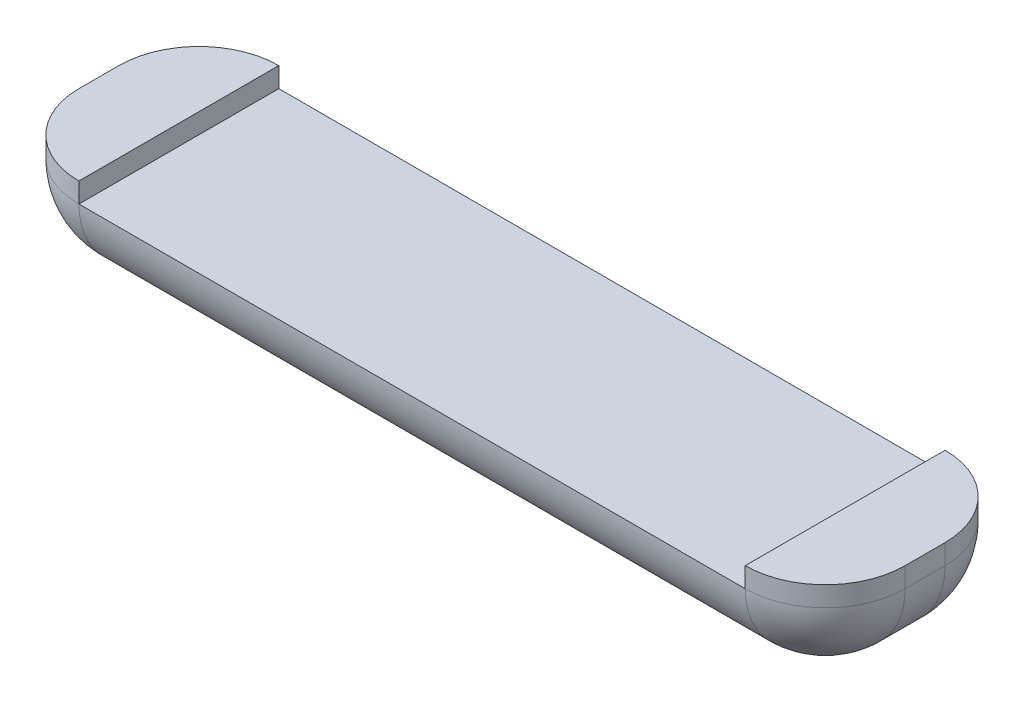
ISO-10303-21;
HEADER;
FILE_DESCRIPTION(('STEP AP214'),'2;1');
FILE_NAME('part.step','',(''),(''),'','','');
FILE_SCHEMA(('AUTOMOTIVE_DESIGN { 1 0 10303 214 1 1 1 1 }'));
ENDSEC;
DATA;
#1=APPLICATION_CONTEXT('core data for automotive mechanical design processes');
#2=APPLICATION_PROTOCOL_DEFINITION('international standard','automotive_design',2000,#1);
#3=PRODUCT_CONTEXT('',#1,'mechanical');
#4=PRODUCT('Part','Part','',(#3));
#5=PRODUCT_RELATED_PRODUCT_CATEGORY('part','',(#4));
#6=PRODUCT_DEFINITION_FORMATION('','',#4);
#7=PRODUCT_DEFINITION_CONTEXT('part definition',#1,'design');
#8=PRODUCT_DEFINITION('design','',#6,#7);
#9=PRODUCT_DEFINITION_SHAPE('','',#8);
#10=(LENGTH_UNIT() NAMED_UNIT(*) SI_UNIT(.MILLI.,.METRE.));
#11=(NAMED_UNIT(*) PLANE_ANGLE_UNIT() SI_UNIT($,.RADIAN.));
#12=(NAMED_UNIT(*) SI_UNIT($,.STERADIAN.) SOLID_ANGLE_UNIT());
#13=UNCERTAINTY_MEASURE_WITH_UNIT(LENGTH_MEASURE(1.E-05),#10,'distance_accuracy_value','');
#14=(GEOMETRIC_REPRESENTATION_CONTEXT(3) GLOBAL_UNCERTAINTY_ASSIGNED_CONTEXT((#13)) GLOBAL_UNIT_ASSIGNED_CONTEXT((#10,
#11,#12)) REPRESENTATION_CONTEXT('',''));
#15=CARTESIAN_POINT('',(0.,0.,0.));
#16=DIRECTION('',(0.,0.,1.));
#17=DIRECTION('',(1.,0.,0.));
#18=AXIS2_PLACEMENT_3D('',#15,#16,#17);
#19=CARTESIAN_POINT('',(62.,-1.5,-1.5));
#20=DIRECTION('',(-1.,0.,0.));
#21=DIRECTION('',(0.,0.,1.));
#22=AXIS2_PLACEMENT_3D('',#19,#20,#21);
#23=CYLINDRICAL_SURFACE('',#22,6.);
#24=DIRECTION('',(-1.,0.,0.));
#25=VECTOR('',#24,1.);
#26=CARTESIAN_POINT('',(62.,-1.49999999999996,-7.5));
#27=LINE('',#26,#25);
#28=CARTESIAN_POINT('',(56.,-1.50000000000004,-7.5));
#29=VERTEX_POINT('',#28);
#30=CARTESIAN_POINT('',(5.99999999999999,-1.50000000000004,-7.5));
#31=VERTEX_POINT('',#30);
#32=EDGE_CURVE('E129',#29,#31,#27,.T.);
#33=ORIENTED_EDGE('',*,*,#32,.F.);
#34=CARTESIAN_POINT('',(56.,-1.5,-1.5));
#35=DIRECTION('',(-1.,0.,0.));
#36=DIRECTION('',(0.,0.,1.));
#37=AXIS2_PLACEMENT_3D('',#34,#35,#36);
#38=CIRCLE('',#37,6.);
#39=CARTESIAN_POINT('',(56.,-7.5,-1.49999999999996));
#40=VERTEX_POINT('',#39);
#41=EDGE_CURVE('E43',#29,#40,#38,.T.);
#42=ORIENTED_EDGE('',*,*,#41,.T.);
#43=DIRECTION('',(-1.,0.,0.));
#44=VECTOR('',#43,1.);
#45=CARTESIAN_POINT('',(62.,-7.5,-1.49999999999996));
#46=LINE('',#45,#44);
#47=CARTESIAN_POINT('',(6.,-7.5,-1.49999999999996));
#48=VERTEX_POINT('',#47);
#49=EDGE_CURVE('E163',#40,#48,#46,.T.);
#50=ORIENTED_EDGE('',*,*,#49,.T.);
#51=CARTESIAN_POINT('',(6.,-1.5,-1.5));
#52=DIRECTION('',(-1.,0.,0.));
#53=DIRECTION('',(0.,0.,1.));
#54=AXIS2_PLACEMENT_3D('',#51,#52,#53);
#55=CIRCLE('',#54,6.);
#56=EDGE_CURVE('E148',#48,#31,#55,.F.);
#57=ORIENTED_EDGE('',*,*,#56,.T.);
#58=EDGE_LOOP('',(#33,#42,#50,#57));
#59=FACE_BOUND('',#58,.T.);
#60=ADVANCED_FACE('F35',(#59),#23,.T.);
#61=CARTESIAN_POINT('',(62.,-1.5,1.5));
#62=DIRECTION('',(-1.,0.,0.));
#63=DIRECTION('',(0.,0.,1.));
#64=AXIS2_PLACEMENT_3D('',#61,#62,#63);
#65=CYLINDRICAL_SURFACE('',#64,6.);
#66=DIRECTION('',(-1.,0.,0.));
#67=VECTOR('',#66,1.);
#68=CARTESIAN_POINT('',(62.,-7.5,1.49999999999996));
#69=LINE('',#68,#67);
#70=CARTESIAN_POINT('',(56.,-7.5,1.49999999999996));
#71=VERTEX_POINT('',#70);
#72=CARTESIAN_POINT('',(6.,-7.5,1.49999999999996));
#73=VERTEX_POINT('',#72);
#74=EDGE_CURVE('E217',#71,#73,#69,.T.);
#75=ORIENTED_EDGE('',*,*,#74,.F.);
#76=CARTESIAN_POINT('',(56.,-1.5,1.5));
#77=DIRECTION('',(-1.,0.,0.));
#78=DIRECTION('',(0.,0.,1.));
#79=AXIS2_PLACEMENT_3D('',#76,#77,#78);
#80=CIRCLE('',#79,6.);
#81=CARTESIAN_POINT('',(56.,-1.49999999999996,7.5));
#82=VERTEX_POINT('',#81);
#83=EDGE_CURVE('E174',#71,#82,#80,.T.);
#84=ORIENTED_EDGE('',*,*,#83,.T.);
#85=DIRECTION('',(-1.,0.,0.));
#86=VECTOR('',#85,1.);
#87=CARTESIAN_POINT('',(62.,-1.49999999999996,7.5));
#88=LINE('',#87,#86);
#89=CARTESIAN_POINT('',(5.99999999999998,-1.50000000000004,7.49999999999994));
#90=VERTEX_POINT('',#89);
#91=EDGE_CURVE('E133',#82,#90,#88,.T.);
#92=ORIENTED_EDGE('',*,*,#91,.T.);
#93=CARTESIAN_POINT('',(6.,-1.5,1.5));
#94=DIRECTION('',(-1.,0.,0.));
#95=DIRECTION('',(0.,0.,1.));
#96=AXIS2_PLACEMENT_3D('',#93,#94,#95);
#97=CIRCLE('',#96,6.);
#98=EDGE_CURVE('E142',#90,#73,#97,.F.);
#99=ORIENTED_EDGE('',*,*,#98,.T.);
#100=EDGE_LOOP('',(#75,#84,#92,#99));
#101=FACE_BOUND('',#100,.T.);
#102=ADVANCED_FACE('F215',(#101),#65,.T.);
#103=CARTESIAN_POINT('',(62.,-7.5,1.49999999999996));
#104=DIRECTION('',(0.,1.,0.));
#105=DIRECTION('',(0.,0.,1.));
#106=AXIS2_PLACEMENT_3D('',#103,#104,#105);
#107=PLANE('',#106);
#108=ORIENTED_EDGE('',*,*,#49,.F.);
#109=DIRECTION('',(0.,0.,-1.));
#110=VECTOR('',#109,1.);
#111=CARTESIAN_POINT('',(56.,-7.5,1.49999999999996));
#112=LINE('',#111,#110);
#113=EDGE_CURVE('E171',#40,#71,#112,.F.);
#114=ORIENTED_EDGE('',*,*,#113,.T.);
#115=ORIENTED_EDGE('',*,*,#74,.T.);
#116=DIRECTION('',(0.,0.,-1.));
#117=VECTOR('',#116,1.);
#118=CARTESIAN_POINT('',(6.,-7.5,-1.49999999999996));
#119=LINE('',#118,#117);
#120=EDGE_CURVE('E145',#73,#48,#119,.T.);
#121=ORIENTED_EDGE('',*,*,#120,.T.);
#122=EDGE_LOOP('',(#108,#114,#115,#121));
#123=FACE_BOUND('',#122,.T.);
#124=ADVANCED_FACE('F261',(#123),#107,.F.);
#125=CARTESIAN_POINT('',(62.,-1.5,-1.5));
#126=DIRECTION('',(-1.,0.,0.));
#127=DIRECTION('',(0.,0.,1.));
#128=AXIS2_PLACEMENT_3D('',#125,#126,#127);
#129=PLANE('',#128);
#130=DIRECTION('',(0.,1.,0.));
#131=VECTOR('',#130,1.);
#132=CARTESIAN_POINT('',(62.,-1.5,-1.5));
#133=LINE('',#132,#131);
#134=CARTESIAN_POINT('',(62.,-1.49999999999996,-1.5));
#135=VERTEX_POINT('',#134);
#136=CARTESIAN_POINT('',(62.,0.,-1.5));
#137=VERTEX_POINT('',#136);
#138=EDGE_CURVE('E150',#135,#137,#133,.T.);
#139=ORIENTED_EDGE('',*,*,#138,.T.);
#140=DIRECTION('',(0.,0.,1.));
#141=VECTOR('',#140,1.);
#142=CARTESIAN_POINT('',(62.,0.,-1.5));
#143=LINE('',#142,#141);
#144=CARTESIAN_POINT('',(62.,0.,1.5));
#145=VERTEX_POINT('',#144);
#146=EDGE_CURVE('E210',#137,#145,#143,.T.);
#147=ORIENTED_EDGE('',*,*,#146,.T.);
#148=DIRECTION('',(0.,-1.,0.));
#149=VECTOR('',#148,1.);
#150=CARTESIAN_POINT('',(62.,-1.5,1.5));
#151=LINE('',#150,#149);
#152=CARTESIAN_POINT('',(62.,-1.5,1.5));
#153=VERTEX_POINT('',#152);
#154=EDGE_CURVE('E166',#145,#153,#151,.T.);
#155=ORIENTED_EDGE('',*,*,#154,.T.);
#156=DIRECTION('',(0.,0.,-1.));
#157=VECTOR('',#156,1.);
#158=CARTESIAN_POINT('',(62.,-1.5,-1.5));
#159=LINE('',#158,#157);
#160=EDGE_CURVE('E168',#153,#135,#159,.T.);
#161=ORIENTED_EDGE('',*,*,#160,.T.);
#162=EDGE_LOOP('',(#139,#147,#155,#161));
#163=FACE_BOUND('',#162,.T.);
#164=ADVANCED_FACE('F278',(#163),#129,.F.);
#165=CARTESIAN_POINT('',(0.,-1.5,-1.5));
#166=DIRECTION('',(-1.,0.,0.));
#167=DIRECTION('',(0.,0.,1.));
#168=AXIS2_PLACEMENT_3D('',#165,#166,#167);
#169=PLANE('',#168);
#170=DIRECTION('',(0.,0.,1.));
#171=VECTOR('',#170,1.);
#172=CARTESIAN_POINT('',(0.,0.,-1.5));
#173=LINE('',#172,#171);
#174=CARTESIAN_POINT('',(0.,0.,-1.49999999999998));
#175=VERTEX_POINT('',#174);
#176=CARTESIAN_POINT('',(0.,0.,1.5));
#177=VERTEX_POINT('',#176);
#178=EDGE_CURVE('E230',#175,#177,#173,.T.);
#179=ORIENTED_EDGE('',*,*,#178,.F.);
#180=DIRECTION('',(0.,1.,0.));
#181=VECTOR('',#180,1.);
#182=CARTESIAN_POINT('',(0.,-1.49999999999996,-1.5));
#183=LINE('',#182,#181);
#184=CARTESIAN_POINT('',(0.,-1.5,-1.49999999999996));
#185=VERTEX_POINT('',#184);
#186=EDGE_CURVE('E121',#175,#185,#183,.F.);
#187=ORIENTED_EDGE('',*,*,#186,.T.);
#188=DIRECTION('',(0.,0.,-1.));
#189=VECTOR('',#188,1.);
#190=CARTESIAN_POINT('',(0.,-1.5,1.49999999999996));
#191=LINE('',#190,#189);
#192=CARTESIAN_POINT('',(0.,-1.5,1.5));
#193=VERTEX_POINT('',#192);
#194=EDGE_CURVE('E128',#185,#193,#191,.F.);
#195=ORIENTED_EDGE('',*,*,#194,.T.);
#196=DIRECTION('',(0.,-1.,0.));
#197=VECTOR('',#196,1.);
#198=CARTESIAN_POINT('',(0.,1.49999999999996,1.5));
#199=LINE('',#198,#197);
#200=EDGE_CURVE('E131',#193,#177,#199,.F.);
#201=ORIENTED_EDGE('',*,*,#200,.T.);
#202=EDGE_LOOP('',(#179,#187,#195,#201));
#203=FACE_BOUND('',#202,.T.);
#204=ADVANCED_FACE('F236',(#203),#169,.T.);
#205=CARTESIAN_POINT('',(6.,-1.49999999999996,1.5));
#206=DIRECTION('',(0.,1.,0.));
#207=DIRECTION('',(0.,0.,1.));
#208=AXIS2_PLACEMENT_3D('',#205,#206,#207);
#209=CYLINDRICAL_SURFACE('',#208,6.);
#210=CARTESIAN_POINT('',(6.,0.,1.5));
#211=DIRECTION('',(0.,-1.,0.));
#212=DIRECTION('',(0.,0.,-1.));
#213=AXIS2_PLACEMENT_3D('',#210,#211,#212);
#214=CIRCLE('',#213,6.);
#215=CARTESIAN_POINT('',(6.,0.,7.5));
#216=VERTEX_POINT('',#215);
#217=EDGE_CURVE('E57',#177,#216,#214,.F.);
#218=ORIENTED_EDGE('',*,*,#217,.F.);
#219=ORIENTED_EDGE('',*,*,#200,.F.);
#220=CARTESIAN_POINT('',(6.,-1.49999999999996,1.5));
#221=DIRECTION('',(0.,-1.,0.));
#222=DIRECTION('',(0.,0.,-1.));
#223=AXIS2_PLACEMENT_3D('',#220,#221,#222);
#224=CIRCLE('',#223,6.);
#225=EDGE_CURVE('E160',#90,#193,#224,.T.);
#226=ORIENTED_EDGE('',*,*,#225,.F.);
#227=DIRECTION('',(0.,-1.,0.));
#228=VECTOR('',#227,1.);
#229=CARTESIAN_POINT('',(6.,-1.49999999999996,7.5));
#230=LINE('',#229,#228);
#231=EDGE_CURVE('E140',#216,#90,#230,.T.);
#232=ORIENTED_EDGE('',*,*,#231,.F.);
#233=EDGE_LOOP('',(#218,#219,#226,#232));
#234=FACE_BOUND('',#233,.T.);
#235=ADVANCED_FACE('F235',(#234),#209,.T.);
#236=CARTESIAN_POINT('',(6.,-1.5,1.5));
#237=DIRECTION('',(-1.,0.,0.));
#238=DIRECTION('',(0.,0.,1.));
#239=AXIS2_PLACEMENT_3D('',#236,#237,#238);
#240=SPHERICAL_SURFACE('',#239,6.);
#241=ORIENTED_EDGE('',*,*,#98,.F.);
#242=ORIENTED_EDGE('',*,*,#225,.T.);
#243=CARTESIAN_POINT('',(6.,-1.5,1.5));
#244=DIRECTION('',(0.,0.,-1.));
#245=DIRECTION('',(0.,1.,0.));
#246=AXIS2_PLACEMENT_3D('',#243,#244,#245);
#247=CIRCLE('',#246,6.);
#248=EDGE_CURVE('E157',#73,#193,#247,.T.);
#249=ORIENTED_EDGE('',*,*,#248,.F.);
#250=EDGE_LOOP('',(#241,#242,#249));
#251=FACE_BOUND('',#250,.T.);
#252=ADVANCED_FACE('F244',(#251),#240,.T.);
#253=CARTESIAN_POINT('',(6.,-1.5,1.49999999999996));
#254=DIRECTION('',(0.,0.,1.));
#255=DIRECTION('',(1.,0.,0.));
#256=AXIS2_PLACEMENT_3D('',#253,#254,#255);
#257=CYLINDRICAL_SURFACE('',#256,6.);
#258=ORIENTED_EDGE('',*,*,#248,.T.);
#259=ORIENTED_EDGE('',*,*,#194,.F.);
#260=CARTESIAN_POINT('',(6.,-1.5,-1.49999999999996));
#261=DIRECTION('',(0.,0.,-1.));
#262=DIRECTION('',(-1.,0.,0.));
#263=AXIS2_PLACEMENT_3D('',#260,#261,#262);
#264=CIRCLE('',#263,6.);
#265=EDGE_CURVE('E153',#48,#185,#264,.T.);
#266=ORIENTED_EDGE('',*,*,#265,.F.);
#267=ORIENTED_EDGE('',*,*,#120,.F.);
#268=EDGE_LOOP('',(#258,#259,#266,#267));
#269=FACE_BOUND('',#268,.T.);
#270=ADVANCED_FACE('F240',(#269),#257,.T.);
#271=CARTESIAN_POINT('',(6.,-1.5,-1.5));
#272=DIRECTION('',(-1.,0.,0.));
#273=DIRECTION('',(0.,0.,1.));
#274=AXIS2_PLACEMENT_3D('',#271,#272,#273);
#275=SPHERICAL_SURFACE('',#274,6.);
#276=ORIENTED_EDGE('',*,*,#56,.F.);
#277=ORIENTED_EDGE('',*,*,#265,.T.);
#278=CARTESIAN_POINT('',(6.,-1.5,-1.5));
#279=DIRECTION('',(0.,1.,0.));
#280=DIRECTION('',(0.,0.,1.));
#281=AXIS2_PLACEMENT_3D('',#278,#279,#280);
#282=CIRCLE('',#281,6.);
#283=EDGE_CURVE('E151',#31,#185,#282,.T.);
#284=ORIENTED_EDGE('',*,*,#283,.F.);
#285=EDGE_LOOP('',(#276,#277,#284));
#286=FACE_BOUND('',#285,.T.);
#287=ADVANCED_FACE('F251',(#286),#275,.T.);
#288=CARTESIAN_POINT('',(6.,-1.49999999999996,-1.5));
#289=DIRECTION('',(0.,-1.,0.));
#290=DIRECTION('',(0.,0.,-1.));
#291=AXIS2_PLACEMENT_3D('',#288,#289,#290);
#292=CYLINDRICAL_SURFACE('',#291,6.);
#293=CARTESIAN_POINT('',(6.,0.,-1.5));
#294=DIRECTION('',(0.,-1.,0.));
#295=DIRECTION('',(0.,0.,-1.));
#296=AXIS2_PLACEMENT_3D('',#293,#294,#295);
#297=CIRCLE('',#296,6.);
#298=CARTESIAN_POINT('',(5.99999999999999,0.,-7.5));
#299=VERTEX_POINT('',#298);
#300=EDGE_CURVE('E110',#299,#175,#297,.F.);
#301=ORIENTED_EDGE('',*,*,#300,.F.);
#302=DIRECTION('',(0.,1.,0.));
#303=VECTOR('',#302,1.);
#304=CARTESIAN_POINT('',(6.,1.49999999999996,-7.5));
#305=LINE('',#304,#303);
#306=EDGE_CURVE('E120',#31,#299,#305,.T.);
#307=ORIENTED_EDGE('',*,*,#306,.F.);
#308=ORIENTED_EDGE('',*,*,#283,.T.);
#309=ORIENTED_EDGE('',*,*,#186,.F.);
#310=EDGE_LOOP('',(#301,#307,#308,#309));
#311=FACE_BOUND('',#310,.T.);
#312=ADVANCED_FACE('F118',(#311),#292,.T.);
#313=CARTESIAN_POINT('',(56.,-1.5,1.5));
#314=DIRECTION('',(0.,-1.,0.));
#315=DIRECTION('',(0.,0.,-1.));
#316=AXIS2_PLACEMENT_3D('',#313,#314,#315);
#317=CYLINDRICAL_SURFACE('',#316,6.);
#318=CARTESIAN_POINT('',(56.,0.,1.5));
#319=DIRECTION('',(0.,-1.,0.));
#320=DIRECTION('',(0.,0.,-1.));
#321=AXIS2_PLACEMENT_3D('',#318,#319,#320);
#322=CIRCLE('',#321,6.);
#323=CARTESIAN_POINT('',(56.,0.,7.5));
#324=VERTEX_POINT('',#323);
#325=EDGE_CURVE('E200',#324,#145,#322,.F.);
#326=ORIENTED_EDGE('',*,*,#325,.F.);
#327=DIRECTION('',(0.,-1.,0.));
#328=VECTOR('',#327,1.);
#329=CARTESIAN_POINT('',(56.,-1.49999999999996,7.5));
#330=LINE('',#329,#328);
#331=EDGE_CURVE('E177',#82,#324,#330,.F.);
#332=ORIENTED_EDGE('',*,*,#331,.F.);
#333=CARTESIAN_POINT('',(56.,-1.5,1.5));
#334=DIRECTION('',(0.,-1.,0.));
#335=DIRECTION('',(0.,0.,-1.));
#336=AXIS2_PLACEMENT_3D('',#333,#334,#335);
#337=CIRCLE('',#336,6.);
#338=EDGE_CURVE('E154',#153,#82,#337,.T.);
#339=ORIENTED_EDGE('',*,*,#338,.F.);
#340=ORIENTED_EDGE('',*,*,#154,.F.);
#341=EDGE_LOOP('',(#326,#332,#339,#340));
#342=FACE_BOUND('',#341,.T.);
#343=ADVANCED_FACE('F37',(#342),#317,.T.);
#344=CARTESIAN_POINT('',(56.,-1.5,-1.5));
#345=DIRECTION('',(0.,1.,0.));
#346=DIRECTION('',(0.,0.,1.));
#347=AXIS2_PLACEMENT_3D('',#344,#345,#346);
#348=CYLINDRICAL_SURFACE('',#347,6.);
#349=CARTESIAN_POINT('',(56.,0.,-1.5));
#350=DIRECTION('',(0.,-1.,0.));
#351=DIRECTION('',(0.,0.,-1.));
#352=AXIS2_PLACEMENT_3D('',#349,#350,#351);
#353=CIRCLE('',#352,6.);
#354=CARTESIAN_POINT('',(56.,0.,-7.5));
#355=VERTEX_POINT('',#354);
#356=EDGE_CURVE('E50',#137,#355,#353,.F.);
#357=ORIENTED_EDGE('',*,*,#356,.F.);
#358=ORIENTED_EDGE('',*,*,#138,.F.);
#359=CARTESIAN_POINT('',(56.,-1.49999999999996,-1.5));
#360=DIRECTION('',(0.,-1.,0.));
#361=DIRECTION('',(0.,0.,-1.));
#362=AXIS2_PLACEMENT_3D('',#359,#360,#361);
#363=CIRCLE('',#362,6.);
#364=EDGE_CURVE('E187',#29,#135,#363,.T.);
#365=ORIENTED_EDGE('',*,*,#364,.F.);
#366=DIRECTION('',(0.,1.,0.));
#367=VECTOR('',#366,1.);
#368=CARTESIAN_POINT('',(56.,-1.49999999999996,-7.5));
#369=LINE('',#368,#367);
#370=EDGE_CURVE('E180',#355,#29,#369,.F.);
#371=ORIENTED_EDGE('',*,*,#370,.F.);
#372=EDGE_LOOP('',(#357,#358,#365,#371));
#373=FACE_BOUND('',#372,.T.);
#374=ADVANCED_FACE('F320',(#373),#348,.T.);
#375=CARTESIAN_POINT('',(56.,-1.5,1.5));
#376=DIRECTION('',(-1.,0.,0.));
#377=DIRECTION('',(0.,0.,1.));
#378=AXIS2_PLACEMENT_3D('',#375,#376,#377);
#379=SPHERICAL_SURFACE('',#378,6.);
#380=ORIENTED_EDGE('',*,*,#338,.T.);
#381=ORIENTED_EDGE('',*,*,#83,.F.);
#382=CARTESIAN_POINT('',(56.,-1.5,1.5));
#383=DIRECTION('',(0.,0.,-1.));
#384=DIRECTION('',(0.,1.,0.));
#385=AXIS2_PLACEMENT_3D('',#382,#383,#384);
#386=CIRCLE('',#385,6.);
#387=EDGE_CURVE('E185',#153,#71,#386,.T.);
#388=ORIENTED_EDGE('',*,*,#387,.F.);
#389=EDGE_LOOP('',(#380,#381,#388));
#390=FACE_BOUND('',#389,.T.);
#391=ADVANCED_FACE('F194',(#390),#379,.T.);
#392=CARTESIAN_POINT('',(56.,-1.5,-1.5));
#393=DIRECTION('',(-1.,0.,0.));
#394=DIRECTION('',(0.,0.,1.));
#395=AXIS2_PLACEMENT_3D('',#392,#393,#394);
#396=SPHERICAL_SURFACE('',#395,6.);
#397=ORIENTED_EDGE('',*,*,#41,.F.);
#398=ORIENTED_EDGE('',*,*,#364,.T.);
#399=CARTESIAN_POINT('',(56.,-1.5,-1.5));
#400=DIRECTION('',(0.,0.,1.));
#401=DIRECTION('',(0.,-1.,0.));
#402=AXIS2_PLACEMENT_3D('',#399,#400,#401);
#403=CIRCLE('',#402,6.);
#404=EDGE_CURVE('E183',#40,#135,#403,.T.);
#405=ORIENTED_EDGE('',*,*,#404,.F.);
#406=EDGE_LOOP('',(#397,#398,#405));
#407=FACE_BOUND('',#406,.T.);
#408=ADVANCED_FACE('F354',(#407),#396,.T.);
#409=CARTESIAN_POINT('',(56.,-1.5,-1.5));
#410=DIRECTION('',(0.,0.,-1.));
#411=DIRECTION('',(-1.,0.,0.));
#412=AXIS2_PLACEMENT_3D('',#409,#410,#411);
#413=CYLINDRICAL_SURFACE('',#412,6.);
#414=ORIENTED_EDGE('',*,*,#387,.T.);
#415=ORIENTED_EDGE('',*,*,#113,.F.);
#416=ORIENTED_EDGE('',*,*,#404,.T.);
#417=ORIENTED_EDGE('',*,*,#160,.F.);
#418=EDGE_LOOP('',(#414,#415,#416,#417));
#419=FACE_BOUND('',#418,.T.);
#420=ADVANCED_FACE('F295',(#419),#413,.T.);
#421=CARTESIAN_POINT('',(31.,-1.50000000000004,-7.50000000000003));
#422=DIRECTION('',(0.,1.,0.));
#423=DIRECTION('',(0.,0.,1.));
#424=AXIS2_PLACEMENT_3D('',#421,#422,#423);
#425=PLANE('',#424);
#426=ORIENTED_EDGE('',*,*,#32,.T.);
#427=DIRECTION('',(0.,0.,-1.));
#428=VECTOR('',#427,1.);
#429=CARTESIAN_POINT('',(5.99999999999998,-1.50000000000004,7.49999999999994));
#430=LINE('',#429,#428);
#431=EDGE_CURVE('E126',#90,#31,#430,.T.);
#432=ORIENTED_EDGE('',*,*,#431,.F.);
#433=ORIENTED_EDGE('',*,*,#91,.F.);
#434=DIRECTION('',(0.,0.,1.));
#435=VECTOR('',#434,1.);
#436=CARTESIAN_POINT('',(56.,-1.50000000000004,7.49999999999999));
#437=LINE('',#436,#435);
#438=EDGE_CURVE('E207',#29,#82,#437,.T.);
#439=ORIENTED_EDGE('',*,*,#438,.F.);
#440=EDGE_LOOP('',(#426,#432,#433,#439));
#441=FACE_BOUND('',#440,.T.);
#442=ADVANCED_FACE('F290',(#441),#425,.T.);
#443=CARTESIAN_POINT('',(56.,-1.50000000000004,7.49999999999999));
#444=DIRECTION('',(-1.,0.,0.));
#445=DIRECTION('',(0.,1.,0.));
#446=AXIS2_PLACEMENT_3D('',#443,#444,#445);
#447=PLANE('',#446);
#448=DIRECTION('',(0.,0.,1.));
#449=VECTOR('',#448,1.);
#450=CARTESIAN_POINT('',(56.,0.,7.49999999999999));
#451=LINE('',#450,#449);
#452=EDGE_CURVE('E204',#355,#324,#451,.T.);
#453=ORIENTED_EDGE('',*,*,#452,.F.);
#454=ORIENTED_EDGE('',*,*,#370,.T.);
#455=ORIENTED_EDGE('',*,*,#438,.T.);
#456=ORIENTED_EDGE('',*,*,#331,.T.);
#457=EDGE_LOOP('',(#453,#454,#455,#456));
#458=FACE_BOUND('',#457,.T.);
#459=ADVANCED_FACE('F203',(#458),#447,.T.);
#460=CARTESIAN_POINT('',(5.99999999999998,-1.50000000000004,7.49999999999994));
#461=DIRECTION('',(1.,0.,0.));
#462=DIRECTION('',(0.,-1.,0.));
#463=AXIS2_PLACEMENT_3D('',#460,#461,#462);
#464=PLANE('',#463);
#465=DIRECTION('',(0.,0.,-1.));
#466=VECTOR('',#465,1.);
#467=CARTESIAN_POINT('',(5.99999999999998,0.,7.49999999999994));
#468=LINE('',#467,#466);
#469=EDGE_CURVE('E11',#216,#299,#468,.T.);
#470=ORIENTED_EDGE('',*,*,#469,.F.);
#471=ORIENTED_EDGE('',*,*,#231,.T.);
#472=ORIENTED_EDGE('',*,*,#431,.T.);
#473=ORIENTED_EDGE('',*,*,#306,.T.);
#474=EDGE_LOOP('',(#470,#471,#472,#473));
#475=FACE_BOUND('',#474,.T.);
#476=ADVANCED_FACE('F124',(#475),#464,.T.);
#477=CARTESIAN_POINT('',(0.,0.,0.));
#478=DIRECTION('',(0.,-1.,0.));
#479=DIRECTION('',(0.,0.,-1.));
#480=AXIS2_PLACEMENT_3D('',#477,#478,#479);
#481=PLANE('',#480);
#482=ORIENTED_EDGE('',*,*,#178,.T.);
#483=ORIENTED_EDGE('',*,*,#217,.T.);
#484=ORIENTED_EDGE('',*,*,#469,.T.);
#485=ORIENTED_EDGE('',*,*,#300,.T.);
#486=EDGE_LOOP('',(#482,#483,#484,#485));
#487=FACE_BOUND('',#486,.T.);
#488=ADVANCED_FACE('F109',(#487),#481,.F.);
#489=ORIENTED_EDGE('',*,*,#356,.T.);
#490=ORIENTED_EDGE('',*,*,#452,.T.);
#491=ORIENTED_EDGE('',*,*,#325,.T.);
#492=ORIENTED_EDGE('',*,*,#146,.F.);
#493=EDGE_LOOP('',(#489,#490,#491,#492));
#494=FACE_BOUND('',#493,.T.);
#495=ADVANCED_FACE('F297',(#494),#481,.F.);
#496=CLOSED_SHELL('',(#60,#102,#124,#164,#204,#235,#252,#270,#287,#312,#343,#374,#391,#408,#420,
#442,#459,#476,#488,#495));
#497=MANIFOLD_SOLID_BREP('B2',#496);
#498=ADVANCED_BREP_SHAPE_REPRESENTATION('',(#18,#497),#14);
#499=SHAPE_DEFINITION_REPRESENTATION(#9,#498);
ENDSEC;
END-ISO-10303-21;
